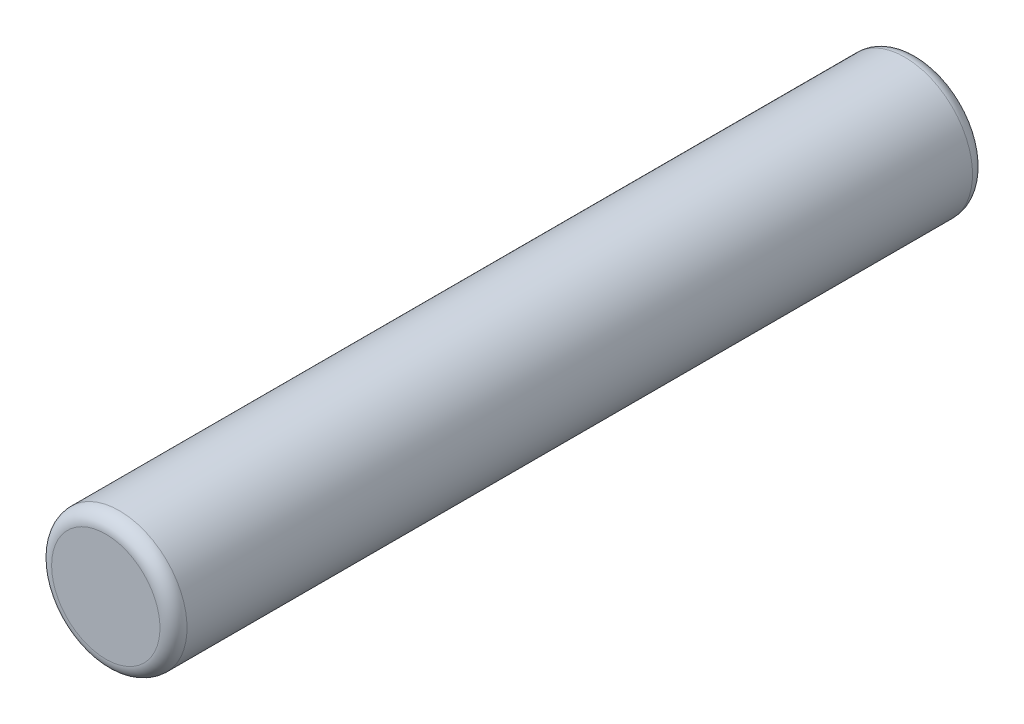
ISO-10303-21;
HEADER;
FILE_DESCRIPTION(('STEP AP214'),'2;1');
FILE_NAME('part.step','',(''),(''),'','','');
FILE_SCHEMA(('AUTOMOTIVE_DESIGN { 1 0 10303 214 1 1 1 1 }'));
ENDSEC;
DATA;
#1=APPLICATION_CONTEXT('core data for automotive mechanical design processes');
#2=APPLICATION_PROTOCOL_DEFINITION('international standard','automotive_design',2000,#1);
#3=PRODUCT_CONTEXT('',#1,'mechanical');
#4=PRODUCT('Part','Part','',(#3));
#5=PRODUCT_RELATED_PRODUCT_CATEGORY('part','',(#4));
#6=PRODUCT_DEFINITION_FORMATION('','',#4);
#7=PRODUCT_DEFINITION_CONTEXT('part definition',#1,'design');
#8=PRODUCT_DEFINITION('design','',#6,#7);
#9=PRODUCT_DEFINITION_SHAPE('','',#8);
#10=(LENGTH_UNIT() NAMED_UNIT(*) SI_UNIT(.MILLI.,.METRE.));
#11=(NAMED_UNIT(*) PLANE_ANGLE_UNIT() SI_UNIT($,.RADIAN.));
#12=(NAMED_UNIT(*) SI_UNIT($,.STERADIAN.) SOLID_ANGLE_UNIT());
#13=UNCERTAINTY_MEASURE_WITH_UNIT(LENGTH_MEASURE(1.E-05),#10,'distance_accuracy_value','');
#14=(GEOMETRIC_REPRESENTATION_CONTEXT(3) GLOBAL_UNCERTAINTY_ASSIGNED_CONTEXT((#13)) GLOBAL_UNIT_ASSIGNED_CONTEXT((#10,
#11,#12)) REPRESENTATION_CONTEXT('',''));
#15=CARTESIAN_POINT('',(0.,0.,0.));
#16=DIRECTION('',(0.,0.,1.));
#17=DIRECTION('',(1.,0.,0.));
#18=AXIS2_PLACEMENT_3D('',#15,#16,#17);
#19=CARTESIAN_POINT('',(-1.9021130325902,0.618033988749743,3.));
#20=DIRECTION('',(0.,0.,1.));
#21=DIRECTION('',(1.,0.,0.));
#22=AXIS2_PLACEMENT_3D('',#19,#20,#21);
#23=PLANE('',#22);
#24=CARTESIAN_POINT('',(-1.9021130325902,0.618033988749743,3.));
#25=DIRECTION('',(0.,0.,-1.));
#26=DIRECTION('',(-1.,0.,0.));
#27=AXIS2_PLACEMENT_3D('',#24,#25,#26);
#28=CIRCLE('',#27,0.4);
#29=CARTESIAN_POINT('',(-2.3021130325902,0.618033988749743,3.));
#30=VERTEX_POINT('',#29);
#31=EDGE_CURVE('E62',#30,#30,#28,.T.);
#32=ORIENTED_EDGE('',*,*,#31,.F.);
#33=EDGE_LOOP('',(#32));
#34=FACE_BOUND('',#33,.T.);
#35=ADVANCED_FACE('F15',(#34),#23,.T.);
#36=CARTESIAN_POINT('',(-1.9021130325902,0.618033988749743,-3.));
#37=DIRECTION('',(0.,0.,1.));
#38=DIRECTION('',(1.,0.,0.));
#39=AXIS2_PLACEMENT_3D('',#36,#37,#38);
#40=PLANE('',#39);
#41=CARTESIAN_POINT('',(-1.9021130325902,0.618033988749743,-3.));
#42=DIRECTION('',(0.,0.,1.));
#43=DIRECTION('',(-1.,0.,0.));
#44=AXIS2_PLACEMENT_3D('',#41,#42,#43);
#45=CIRCLE('',#44,0.4);
#46=CARTESIAN_POINT('',(-2.3021130325902,0.618033988749743,-3.));
#47=VERTEX_POINT('',#46);
#48=EDGE_CURVE('E30',#47,#47,#45,.T.);
#49=ORIENTED_EDGE('',*,*,#48,.F.);
#50=EDGE_LOOP('',(#49));
#51=FACE_BOUND('',#50,.T.);
#52=ADVANCED_FACE('F75',(#51),#40,.F.);
#53=CARTESIAN_POINT('',(-1.9021130325902,0.618033988749743,2.9));
#54=DIRECTION('',(0.,0.,-1.));
#55=DIRECTION('',(1.,0.,0.));
#56=AXIS2_PLACEMENT_3D('',#53,#54,#55);
#57=TOROIDAL_SURFACE('',#56,0.4,0.1);
#58=ORIENTED_EDGE('',*,*,#31,.T.);
#59=EDGE_LOOP('',(#58));
#60=FACE_BOUND('',#59,.T.);
#61=CARTESIAN_POINT('',(-1.9021130325902,0.618033988749743,2.9));
#62=DIRECTION('',(0.,0.,-1.));
#63=DIRECTION('',(-1.,0.,0.));
#64=AXIS2_PLACEMENT_3D('',#61,#62,#63);
#65=CIRCLE('',#64,0.5);
#66=CARTESIAN_POINT('',(-2.4021130325902,0.618033988749743,2.9));
#67=VERTEX_POINT('',#66);
#68=EDGE_CURVE('E25',#67,#67,#65,.T.);
#69=ORIENTED_EDGE('',*,*,#68,.F.);
#70=EDGE_LOOP('',(#69));
#71=FACE_BOUND('',#70,.T.);
#72=ADVANCED_FACE('F43',(#60,#71),#57,.T.);
#73=CARTESIAN_POINT('',(-1.9021130325902,0.618033988749743,-2.9));
#74=DIRECTION('',(0.,0.,-1.));
#75=DIRECTION('',(1.,0.,0.));
#76=AXIS2_PLACEMENT_3D('',#73,#74,#75);
#77=TOROIDAL_SURFACE('',#76,0.4,0.1);
#78=CARTESIAN_POINT('',(-1.9021130325902,0.618033988749743,-2.9));
#79=DIRECTION('',(0.,0.,-1.));
#80=DIRECTION('',(-1.,0.,0.));
#81=AXIS2_PLACEMENT_3D('',#78,#79,#80);
#82=CIRCLE('',#81,0.5);
#83=CARTESIAN_POINT('',(-2.4021130325902,0.618033988749743,-2.9));
#84=VERTEX_POINT('',#83);
#85=EDGE_CURVE('E10',#84,#84,#82,.F.);
#86=ORIENTED_EDGE('',*,*,#85,.F.);
#87=EDGE_LOOP('',(#86));
#88=FACE_BOUND('',#87,.T.);
#89=ORIENTED_EDGE('',*,*,#48,.T.);
#90=EDGE_LOOP('',(#89));
#91=FACE_BOUND('',#90,.T.);
#92=ADVANCED_FACE('F38',(#88,#91),#77,.T.);
#93=CARTESIAN_POINT('',(-1.9021130325902,0.618033988749743,-3.));
#94=DIRECTION('',(0.,0.,-1.));
#95=DIRECTION('',(-1.,0.,0.));
#96=AXIS2_PLACEMENT_3D('',#93,#94,#95);
#97=CYLINDRICAL_SURFACE('',#96,0.5);
#98=ORIENTED_EDGE('',*,*,#85,.T.);
#99=EDGE_LOOP('',(#98));
#100=FACE_BOUND('',#99,.T.);
#101=ORIENTED_EDGE('',*,*,#68,.T.);
#102=EDGE_LOOP('',(#101));
#103=FACE_BOUND('',#102,.T.);
#104=ADVANCED_FACE('F42',(#100,#103),#97,.T.);
#105=CLOSED_SHELL('',(#35,#52,#72,#92,#104));
#106=MANIFOLD_SOLID_BREP('B1',#105);
#107=ADVANCED_BREP_SHAPE_REPRESENTATION('',(#18,#106),#14);
#108=SHAPE_DEFINITION_REPRESENTATION(#9,#107);
ENDSEC;
END-ISO-10303-21;
